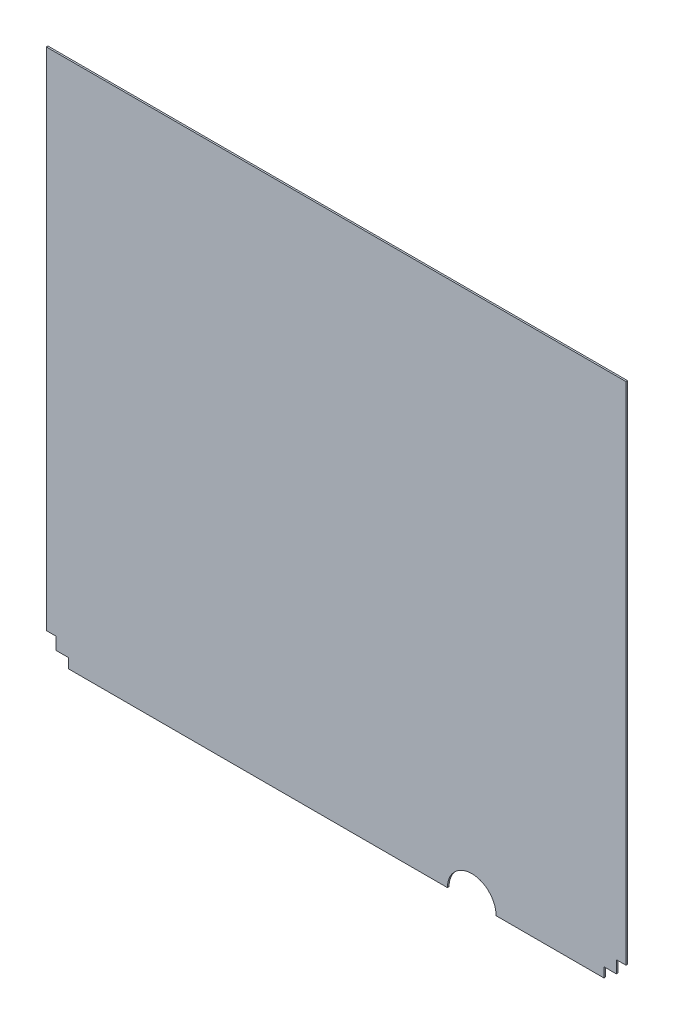
ISO-10303-21;
HEADER;
FILE_DESCRIPTION(('STEP AP214'),'2;1');
FILE_NAME('part.step','',(''),(''),'','','');
FILE_SCHEMA(('AUTOMOTIVE_DESIGN { 1 0 10303 214 1 1 1 1 }'));
ENDSEC;
DATA;
#1=APPLICATION_CONTEXT('core data for automotive mechanical design processes');
#2=APPLICATION_PROTOCOL_DEFINITION('international standard','automotive_design',2000,#1);
#3=PRODUCT_CONTEXT('',#1,'mechanical');
#4=PRODUCT('Part','Part','',(#3));
#5=PRODUCT_RELATED_PRODUCT_CATEGORY('part','',(#4));
#6=PRODUCT_DEFINITION_FORMATION('','',#4);
#7=PRODUCT_DEFINITION_CONTEXT('part definition',#1,'design');
#8=PRODUCT_DEFINITION('design','',#6,#7);
#9=PRODUCT_DEFINITION_SHAPE('','',#8);
#10=(LENGTH_UNIT() NAMED_UNIT(*) SI_UNIT(.MILLI.,.METRE.));
#11=(NAMED_UNIT(*) PLANE_ANGLE_UNIT() SI_UNIT($,.RADIAN.));
#12=(NAMED_UNIT(*) SI_UNIT($,.STERADIAN.) SOLID_ANGLE_UNIT());
#13=UNCERTAINTY_MEASURE_WITH_UNIT(LENGTH_MEASURE(1.E-05),#10,'distance_accuracy_value','');
#14=(GEOMETRIC_REPRESENTATION_CONTEXT(3) GLOBAL_UNCERTAINTY_ASSIGNED_CONTEXT((#13)) GLOBAL_UNIT_ASSIGNED_CONTEXT((#10,
#11,#12)) REPRESENTATION_CONTEXT('',''));
#15=CARTESIAN_POINT('',(0.,0.,0.));
#16=DIRECTION('',(0.,0.,1.));
#17=DIRECTION('',(1.,0.,0.));
#18=AXIS2_PLACEMENT_3D('',#15,#16,#17);
#19=CARTESIAN_POINT('',(665.70098,0.,2.54));
#20=DIRECTION('',(0.,0.,-1.));
#21=DIRECTION('',(-1.,0.,0.));
#22=AXIS2_PLACEMENT_3D('',#19,#20,#21);
#23=CYLINDRICAL_SURFACE('',#22,38.1);
#24=CARTESIAN_POINT('',(665.70098,0.,0.));
#25=DIRECTION('',(0.,0.,1.));
#26=DIRECTION('',(1.,0.,0.));
#27=AXIS2_PLACEMENT_3D('',#24,#25,#26);
#28=CIRCLE('',#27,38.1);
#29=CARTESIAN_POINT('',(703.80098,0.,0.));
#30=VERTEX_POINT('',#29);
#31=CARTESIAN_POINT('',(627.60098,0.,0.));
#32=VERTEX_POINT('',#31);
#33=EDGE_CURVE('E182',#30,#32,#28,.T.);
#34=ORIENTED_EDGE('',*,*,#33,.F.);
#35=DIRECTION('',(0.,0.,-1.));
#36=VECTOR('',#35,1.);
#37=CARTESIAN_POINT('',(703.80098,0.,2.54));
#38=LINE('',#37,#36);
#39=CARTESIAN_POINT('',(703.80098,0.,2.54));
#40=VERTEX_POINT('',#39);
#41=EDGE_CURVE('E11',#40,#30,#38,.T.);
#42=ORIENTED_EDGE('',*,*,#41,.F.);
#43=CARTESIAN_POINT('',(665.70098,0.,2.54));
#44=DIRECTION('',(0.,0.,1.));
#45=DIRECTION('',(1.,0.,0.));
#46=AXIS2_PLACEMENT_3D('',#43,#44,#45);
#47=CIRCLE('',#46,38.1);
#48=CARTESIAN_POINT('',(627.60098,0.,2.54));
#49=VERTEX_POINT('',#48);
#50=EDGE_CURVE('E287',#40,#49,#47,.T.);
#51=ORIENTED_EDGE('',*,*,#50,.T.);
#52=DIRECTION('',(0.,0.,-1.));
#53=VECTOR('',#52,1.);
#54=CARTESIAN_POINT('',(627.60098,0.,2.54));
#55=LINE('',#54,#53);
#56=EDGE_CURVE('E117',#49,#32,#55,.T.);
#57=ORIENTED_EDGE('',*,*,#56,.T.);
#58=EDGE_LOOP('',(#34,#42,#51,#57));
#59=FACE_BOUND('',#58,.T.);
#60=ADVANCED_FACE('F47',(#59),#23,.F.);
#61=CARTESIAN_POINT('',(0.,0.,2.54));
#62=DIRECTION('',(0.,1.,0.));
#63=DIRECTION('',(0.,0.,1.));
#64=AXIS2_PLACEMENT_3D('',#61,#62,#63);
#65=PLANE('',#64);
#66=DIRECTION('',(1.,0.,0.));
#67=VECTOR('',#66,1.);
#68=CARTESIAN_POINT('',(0.,0.,0.));
#69=LINE('',#68,#67);
#70=CARTESIAN_POINT('',(872.45698,0.,0.));
#71=VERTEX_POINT('',#70);
#72=EDGE_CURVE('E186',#30,#71,#69,.T.);
#73=ORIENTED_EDGE('',*,*,#72,.T.);
#74=DIRECTION('',(0.,0.,-1.));
#75=VECTOR('',#74,1.);
#76=CARTESIAN_POINT('',(872.45698,0.,2.54));
#77=LINE('',#76,#75);
#78=CARTESIAN_POINT('',(872.45698,0.,2.54));
#79=VERTEX_POINT('',#78);
#80=EDGE_CURVE('E56',#79,#71,#77,.T.);
#81=ORIENTED_EDGE('',*,*,#80,.F.);
#82=DIRECTION('',(1.,0.,0.));
#83=VECTOR('',#82,1.);
#84=CARTESIAN_POINT('',(0.,0.,2.54));
#85=LINE('',#84,#83);
#86=EDGE_CURVE('E179',#40,#79,#85,.T.);
#87=ORIENTED_EDGE('',*,*,#86,.F.);
#88=ORIENTED_EDGE('',*,*,#41,.T.);
#89=EDGE_LOOP('',(#73,#81,#87,#88));
#90=FACE_BOUND('',#89,.T.);
#91=ADVANCED_FACE('F269',(#90),#65,.F.);
#92=CARTESIAN_POINT('',(872.45698,0.,2.54));
#93=DIRECTION('',(1.,0.,0.));
#94=DIRECTION('',(0.,0.,-1.));
#95=AXIS2_PLACEMENT_3D('',#92,#93,#94);
#96=PLANE('',#95);
#97=DIRECTION('',(0.,-1.,0.));
#98=VECTOR('',#97,1.);
#99=CARTESIAN_POINT('',(872.45698,0.,0.));
#100=LINE('',#99,#98);
#101=CARTESIAN_POINT('',(872.45698,15.24,0.));
#102=VERTEX_POINT('',#101);
#103=EDGE_CURVE('E190',#102,#71,#100,.T.);
#104=ORIENTED_EDGE('',*,*,#103,.F.);
#105=DIRECTION('',(0.,0.,-1.));
#106=VECTOR('',#105,1.);
#107=CARTESIAN_POINT('',(872.45698,15.24,2.54));
#108=LINE('',#107,#106);
#109=CARTESIAN_POINT('',(872.45698,15.24,2.54));
#110=VERTEX_POINT('',#109);
#111=EDGE_CURVE('E257',#110,#102,#108,.T.);
#112=ORIENTED_EDGE('',*,*,#111,.F.);
#113=DIRECTION('',(0.,-1.,0.));
#114=VECTOR('',#113,1.);
#115=CARTESIAN_POINT('',(872.45698,0.,2.54));
#116=LINE('',#115,#114);
#117=EDGE_CURVE('E266',#110,#79,#116,.T.);
#118=ORIENTED_EDGE('',*,*,#117,.T.);
#119=ORIENTED_EDGE('',*,*,#80,.T.);
#120=EDGE_LOOP('',(#104,#112,#118,#119));
#121=FACE_BOUND('',#120,.T.);
#122=ADVANCED_FACE('F264',(#121),#96,.T.);
#123=CARTESIAN_POINT('',(0.,15.2399999999999,2.54));
#124=DIRECTION('',(0.,-1.,0.));
#125=DIRECTION('',(1.,0.,0.));
#126=AXIS2_PLACEMENT_3D('',#123,#124,#125);
#127=PLANE('',#126);
#128=DIRECTION('',(-1.,0.,0.));
#129=VECTOR('',#128,1.);
#130=CARTESIAN_POINT('',(0.,15.2399999999999,0.));
#131=LINE('',#130,#129);
#132=CARTESIAN_POINT('',(891.76098,15.24,0.));
#133=VERTEX_POINT('',#132);
#134=EDGE_CURVE('E195',#133,#102,#131,.T.);
#135=ORIENTED_EDGE('',*,*,#134,.F.);
#136=DIRECTION('',(0.,0.,-1.));
#137=VECTOR('',#136,1.);
#138=CARTESIAN_POINT('',(891.76098,15.24,2.54));
#139=LINE('',#138,#137);
#140=CARTESIAN_POINT('',(891.76098,15.24,2.54));
#141=VERTEX_POINT('',#140);
#142=EDGE_CURVE('E254',#141,#133,#139,.T.);
#143=ORIENTED_EDGE('',*,*,#142,.F.);
#144=DIRECTION('',(-1.,0.,0.));
#145=VECTOR('',#144,1.);
#146=CARTESIAN_POINT('',(0.,15.2399999999999,2.54));
#147=LINE('',#146,#145);
#148=EDGE_CURVE('E278',#141,#110,#147,.T.);
#149=ORIENTED_EDGE('',*,*,#148,.T.);
#150=ORIENTED_EDGE('',*,*,#111,.T.);
#151=EDGE_LOOP('',(#135,#143,#149,#150));
#152=FACE_BOUND('',#151,.T.);
#153=ADVANCED_FACE('F275',(#152),#127,.T.);
#154=CARTESIAN_POINT('',(891.76098,0.,2.54));
#155=DIRECTION('',(1.,0.,0.));
#156=DIRECTION('',(0.,0.,-1.));
#157=AXIS2_PLACEMENT_3D('',#154,#155,#156);
#158=PLANE('',#157);
#159=DIRECTION('',(0.,-1.,0.));
#160=VECTOR('',#159,1.);
#161=CARTESIAN_POINT('',(891.76098,0.,0.));
#162=LINE('',#161,#160);
#163=CARTESIAN_POINT('',(891.76098,34.544,0.));
#164=VERTEX_POINT('',#163);
#165=EDGE_CURVE('E199',#164,#133,#162,.T.);
#166=ORIENTED_EDGE('',*,*,#165,.F.);
#167=DIRECTION('',(0.,0.,-1.));
#168=VECTOR('',#167,1.);
#169=CARTESIAN_POINT('',(891.76098,34.544,2.54));
#170=LINE('',#169,#168);
#171=CARTESIAN_POINT('',(891.76098,34.544,2.54));
#172=VERTEX_POINT('',#171);
#173=EDGE_CURVE('E251',#172,#164,#170,.T.);
#174=ORIENTED_EDGE('',*,*,#173,.F.);
#175=DIRECTION('',(0.,-1.,0.));
#176=VECTOR('',#175,1.);
#177=CARTESIAN_POINT('',(891.76098,0.,2.54));
#178=LINE('',#177,#176);
#179=EDGE_CURVE('E285',#172,#141,#178,.T.);
#180=ORIENTED_EDGE('',*,*,#179,.T.);
#181=ORIENTED_EDGE('',*,*,#142,.T.);
#182=EDGE_LOOP('',(#166,#174,#180,#181));
#183=FACE_BOUND('',#182,.T.);
#184=ADVANCED_FACE('F365',(#183),#158,.T.);
#185=CARTESIAN_POINT('',(0.,34.5439999999996,2.54));
#186=DIRECTION('',(0.,-1.,0.));
#187=DIRECTION('',(1.,0.,0.));
#188=AXIS2_PLACEMENT_3D('',#185,#186,#187);
#189=PLANE('',#188);
#190=DIRECTION('',(-1.,0.,0.));
#191=VECTOR('',#190,1.);
#192=CARTESIAN_POINT('',(0.,34.5439999999996,0.));
#193=LINE('',#192,#191);
#194=CARTESIAN_POINT('',(907.00098,34.544,0.));
#195=VERTEX_POINT('',#194);
#196=EDGE_CURVE('E203',#195,#164,#193,.T.);
#197=ORIENTED_EDGE('',*,*,#196,.F.);
#198=DIRECTION('',(0.,0.,-1.));
#199=VECTOR('',#198,1.);
#200=CARTESIAN_POINT('',(907.00098,34.544,2.54));
#201=LINE('',#200,#199);
#202=CARTESIAN_POINT('',(907.00098,34.544,2.54));
#203=VERTEX_POINT('',#202);
#204=EDGE_CURVE('E248',#203,#195,#201,.T.);
#205=ORIENTED_EDGE('',*,*,#204,.F.);
#206=DIRECTION('',(-1.,0.,0.));
#207=VECTOR('',#206,1.);
#208=CARTESIAN_POINT('',(0.,34.5439999999996,2.54));
#209=LINE('',#208,#207);
#210=EDGE_CURVE('E292',#203,#172,#209,.T.);
#211=ORIENTED_EDGE('',*,*,#210,.T.);
#212=ORIENTED_EDGE('',*,*,#173,.T.);
#213=EDGE_LOOP('',(#197,#205,#211,#212));
#214=FACE_BOUND('',#213,.T.);
#215=ADVANCED_FACE('F361',(#214),#189,.T.);
#216=CARTESIAN_POINT('',(907.00098,0.,2.54));
#217=DIRECTION('',(-1.,0.,0.));
#218=DIRECTION('',(0.,0.,1.));
#219=AXIS2_PLACEMENT_3D('',#216,#217,#218);
#220=PLANE('',#219);
#221=DIRECTION('',(0.,1.,0.));
#222=VECTOR('',#221,1.);
#223=CARTESIAN_POINT('',(907.00098,0.,0.));
#224=LINE('',#223,#222);
#225=CARTESIAN_POINT('',(907.00098,825.5,0.));
#226=VERTEX_POINT('',#225);
#227=EDGE_CURVE('E207',#195,#226,#224,.T.);
#228=ORIENTED_EDGE('',*,*,#227,.T.);
#229=DIRECTION('',(0.,0.,-1.));
#230=VECTOR('',#229,1.);
#231=CARTESIAN_POINT('',(907.00098,825.5,2.54));
#232=LINE('',#231,#230);
#233=CARTESIAN_POINT('',(907.00098,825.5,2.54));
#234=VERTEX_POINT('',#233);
#235=EDGE_CURVE('E245',#234,#226,#232,.T.);
#236=ORIENTED_EDGE('',*,*,#235,.F.);
#237=DIRECTION('',(0.,1.,0.));
#238=VECTOR('',#237,1.);
#239=CARTESIAN_POINT('',(907.00098,0.,2.54));
#240=LINE('',#239,#238);
#241=EDGE_CURVE('E296',#203,#234,#240,.T.);
#242=ORIENTED_EDGE('',*,*,#241,.F.);
#243=ORIENTED_EDGE('',*,*,#204,.T.);
#244=EDGE_LOOP('',(#228,#236,#242,#243));
#245=FACE_BOUND('',#244,.T.);
#246=ADVANCED_FACE('F357',(#245),#220,.F.);
#247=CARTESIAN_POINT('',(0.,825.5,2.54));
#248=DIRECTION('',(0.,1.,0.));
#249=DIRECTION('',(0.,0.,1.));
#250=AXIS2_PLACEMENT_3D('',#247,#248,#249);
#251=PLANE('',#250);
#252=DIRECTION('',(1.,0.,0.));
#253=VECTOR('',#252,1.);
#254=CARTESIAN_POINT('',(0.,825.5,0.));
#255=LINE('',#254,#253);
#256=CARTESIAN_POINT('',(0.,825.5,0.));
#257=VERTEX_POINT('',#256);
#258=EDGE_CURVE('E211',#257,#226,#255,.T.);
#259=ORIENTED_EDGE('',*,*,#258,.F.);
#260=DIRECTION('',(0.,0.,-1.));
#261=VECTOR('',#260,1.);
#262=CARTESIAN_POINT('',(0.,825.5,2.54));
#263=LINE('',#262,#261);
#264=CARTESIAN_POINT('',(0.,825.5,2.54));
#265=VERTEX_POINT('',#264);
#266=EDGE_CURVE('E242',#265,#257,#263,.T.);
#267=ORIENTED_EDGE('',*,*,#266,.F.);
#268=DIRECTION('',(1.,0.,0.));
#269=VECTOR('',#268,1.);
#270=CARTESIAN_POINT('',(0.,825.5,2.54));
#271=LINE('',#270,#269);
#272=EDGE_CURVE('E299',#265,#234,#271,.T.);
#273=ORIENTED_EDGE('',*,*,#272,.T.);
#274=ORIENTED_EDGE('',*,*,#235,.T.);
#275=EDGE_LOOP('',(#259,#267,#273,#274));
#276=FACE_BOUND('',#275,.T.);
#277=ADVANCED_FACE('F353',(#276),#251,.T.);
#278=CARTESIAN_POINT('',(0.,0.,2.54));
#279=DIRECTION('',(-1.,0.,0.));
#280=DIRECTION('',(0.,0.,1.));
#281=AXIS2_PLACEMENT_3D('',#278,#279,#280);
#282=PLANE('',#281);
#283=DIRECTION('',(0.,1.,0.));
#284=VECTOR('',#283,1.);
#285=CARTESIAN_POINT('',(0.,0.,0.));
#286=LINE('',#285,#284);
#287=CARTESIAN_POINT('',(0.,34.544,0.));
#288=VERTEX_POINT('',#287);
#289=EDGE_CURVE('E215',#288,#257,#286,.T.);
#290=ORIENTED_EDGE('',*,*,#289,.F.);
#291=DIRECTION('',(0.,0.,-1.));
#292=VECTOR('',#291,1.);
#293=CARTESIAN_POINT('',(0.,34.544,2.54));
#294=LINE('',#293,#292);
#295=CARTESIAN_POINT('',(0.,34.544,2.54));
#296=VERTEX_POINT('',#295);
#297=EDGE_CURVE('E239',#296,#288,#294,.T.);
#298=ORIENTED_EDGE('',*,*,#297,.F.);
#299=DIRECTION('',(0.,1.,0.));
#300=VECTOR('',#299,1.);
#301=CARTESIAN_POINT('',(0.,0.,2.54));
#302=LINE('',#301,#300);
#303=EDGE_CURVE('E303',#296,#265,#302,.T.);
#304=ORIENTED_EDGE('',*,*,#303,.T.);
#305=ORIENTED_EDGE('',*,*,#266,.T.);
#306=EDGE_LOOP('',(#290,#298,#304,#305));
#307=FACE_BOUND('',#306,.T.);
#308=ADVANCED_FACE('F350',(#307),#282,.T.);
#309=CARTESIAN_POINT('',(0.,34.544,2.54));
#310=DIRECTION('',(0.,1.,0.));
#311=DIRECTION('',(0.,0.,1.));
#312=AXIS2_PLACEMENT_3D('',#309,#310,#311);
#313=PLANE('',#312);
#314=DIRECTION('',(1.,0.,0.));
#315=VECTOR('',#314,1.);
#316=CARTESIAN_POINT('',(0.,34.544,0.));
#317=LINE('',#316,#315);
#318=CARTESIAN_POINT('',(15.24,34.544,0.));
#319=VERTEX_POINT('',#318);
#320=EDGE_CURVE('E219',#288,#319,#317,.T.);
#321=ORIENTED_EDGE('',*,*,#320,.T.);
#322=DIRECTION('',(0.,0.,-1.));
#323=VECTOR('',#322,1.);
#324=CARTESIAN_POINT('',(15.24,34.544,2.54));
#325=LINE('',#324,#323);
#326=CARTESIAN_POINT('',(15.24,34.544,2.54));
#327=VERTEX_POINT('',#326);
#328=EDGE_CURVE('E235',#327,#319,#325,.T.);
#329=ORIENTED_EDGE('',*,*,#328,.F.);
#330=DIRECTION('',(1.,0.,0.));
#331=VECTOR('',#330,1.);
#332=CARTESIAN_POINT('',(0.,34.544,2.54));
#333=LINE('',#332,#331);
#334=EDGE_CURVE('E307',#296,#327,#333,.T.);
#335=ORIENTED_EDGE('',*,*,#334,.F.);
#336=ORIENTED_EDGE('',*,*,#297,.T.);
#337=EDGE_LOOP('',(#321,#329,#335,#336));
#338=FACE_BOUND('',#337,.T.);
#339=ADVANCED_FACE('F315',(#338),#313,.F.);
#340=CARTESIAN_POINT('',(15.24,0.,2.54));
#341=DIRECTION('',(1.,0.,0.));
#342=DIRECTION('',(0.,1.,0.));
#343=AXIS2_PLACEMENT_3D('',#340,#341,#342);
#344=PLANE('',#343);
#345=DIRECTION('',(0.,-1.,0.));
#346=VECTOR('',#345,1.);
#347=CARTESIAN_POINT('',(15.24,0.,0.));
#348=LINE('',#347,#346);
#349=CARTESIAN_POINT('',(15.24,15.24,0.));
#350=VERTEX_POINT('',#349);
#351=EDGE_CURVE('E222',#319,#350,#348,.T.);
#352=ORIENTED_EDGE('',*,*,#351,.T.);
#353=DIRECTION('',(0.,0.,-1.));
#354=VECTOR('',#353,1.);
#355=CARTESIAN_POINT('',(15.24,15.24,2.54));
#356=LINE('',#355,#354);
#357=CARTESIAN_POINT('',(15.24,15.24,2.54));
#358=VERTEX_POINT('',#357);
#359=EDGE_CURVE('E171',#358,#350,#356,.T.);
#360=ORIENTED_EDGE('',*,*,#359,.F.);
#361=DIRECTION('',(0.,-1.,0.));
#362=VECTOR('',#361,1.);
#363=CARTESIAN_POINT('',(15.24,0.,2.54));
#364=LINE('',#363,#362);
#365=EDGE_CURVE('E160',#327,#358,#364,.T.);
#366=ORIENTED_EDGE('',*,*,#365,.F.);
#367=ORIENTED_EDGE('',*,*,#328,.T.);
#368=EDGE_LOOP('',(#352,#360,#366,#367));
#369=FACE_BOUND('',#368,.T.);
#370=ADVANCED_FACE('F319',(#369),#344,.F.);
#371=CARTESIAN_POINT('',(0.,15.24,2.54));
#372=DIRECTION('',(0.,1.,0.));
#373=DIRECTION('',(0.,0.,1.));
#374=AXIS2_PLACEMENT_3D('',#371,#372,#373);
#375=PLANE('',#374);
#376=DIRECTION('',(1.,0.,0.));
#377=VECTOR('',#376,1.);
#378=CARTESIAN_POINT('',(0.,15.24,0.));
#379=LINE('',#378,#377);
#380=CARTESIAN_POINT('',(34.544,15.24,0.));
#381=VERTEX_POINT('',#380);
#382=EDGE_CURVE('E169',#350,#381,#379,.T.);
#383=ORIENTED_EDGE('',*,*,#382,.T.);
#384=DIRECTION('',(0.,0.,-1.));
#385=VECTOR('',#384,1.);
#386=CARTESIAN_POINT('',(34.544,15.24,2.54));
#387=LINE('',#386,#385);
#388=CARTESIAN_POINT('',(34.544,15.24,2.54));
#389=VERTEX_POINT('',#388);
#390=EDGE_CURVE('E166',#389,#381,#387,.T.);
#391=ORIENTED_EDGE('',*,*,#390,.F.);
#392=DIRECTION('',(1.,0.,0.));
#393=VECTOR('',#392,1.);
#394=CARTESIAN_POINT('',(0.,15.24,2.54));
#395=LINE('',#394,#393);
#396=EDGE_CURVE('E154',#358,#389,#395,.T.);
#397=ORIENTED_EDGE('',*,*,#396,.F.);
#398=ORIENTED_EDGE('',*,*,#359,.T.);
#399=EDGE_LOOP('',(#383,#391,#397,#398));
#400=FACE_BOUND('',#399,.T.);
#401=ADVANCED_FACE('F167',(#400),#375,.F.);
#402=CARTESIAN_POINT('',(34.544,0.,2.54));
#403=DIRECTION('',(1.,0.,0.));
#404=DIRECTION('',(0.,0.,-1.));
#405=AXIS2_PLACEMENT_3D('',#402,#403,#404);
#406=PLANE('',#405);
#407=DIRECTION('',(0.,-1.,0.));
#408=VECTOR('',#407,1.);
#409=CARTESIAN_POINT('',(34.544,0.,0.));
#410=LINE('',#409,#408);
#411=CARTESIAN_POINT('',(34.544,0.,0.));
#412=VERTEX_POINT('',#411);
#413=EDGE_CURVE('E110',#381,#412,#410,.T.);
#414=ORIENTED_EDGE('',*,*,#413,.T.);
#415=DIRECTION('',(0.,0.,-1.));
#416=VECTOR('',#415,1.);
#417=CARTESIAN_POINT('',(34.544,0.,2.54));
#418=LINE('',#417,#416);
#419=CARTESIAN_POINT('',(34.544,0.,2.54));
#420=VERTEX_POINT('',#419);
#421=EDGE_CURVE('E172',#420,#412,#418,.T.);
#422=ORIENTED_EDGE('',*,*,#421,.F.);
#423=DIRECTION('',(0.,-1.,0.));
#424=VECTOR('',#423,1.);
#425=CARTESIAN_POINT('',(34.544,0.,2.54));
#426=LINE('',#425,#424);
#427=EDGE_CURVE('E158',#389,#420,#426,.T.);
#428=ORIENTED_EDGE('',*,*,#427,.F.);
#429=ORIENTED_EDGE('',*,*,#390,.T.);
#430=EDGE_LOOP('',(#414,#422,#428,#429));
#431=FACE_BOUND('',#430,.T.);
#432=ADVANCED_FACE('F174',(#431),#406,.F.);
#433=EDGE_CURVE('E191',#412,#32,#69,.T.);
#434=ORIENTED_EDGE('',*,*,#433,.T.);
#435=ORIENTED_EDGE('',*,*,#56,.F.);
#436=EDGE_CURVE('E64',#420,#49,#85,.T.);
#437=ORIENTED_EDGE('',*,*,#436,.F.);
#438=ORIENTED_EDGE('',*,*,#421,.T.);
#439=EDGE_LOOP('',(#434,#435,#437,#438));
#440=FACE_BOUND('',#439,.T.);
#441=ADVANCED_FACE('F329',(#440),#65,.F.);
#442=CARTESIAN_POINT('',(0.,0.,2.54));
#443=DIRECTION('',(0.,0.,1.));
#444=DIRECTION('',(1.,0.,0.));
#445=AXIS2_PLACEMENT_3D('',#442,#443,#444);
#446=PLANE('',#445);
#447=ORIENTED_EDGE('',*,*,#50,.F.);
#448=ORIENTED_EDGE('',*,*,#86,.T.);
#449=ORIENTED_EDGE('',*,*,#117,.F.);
#450=ORIENTED_EDGE('',*,*,#148,.F.);
#451=ORIENTED_EDGE('',*,*,#179,.F.);
#452=ORIENTED_EDGE('',*,*,#210,.F.);
#453=ORIENTED_EDGE('',*,*,#241,.T.);
#454=ORIENTED_EDGE('',*,*,#272,.F.);
#455=ORIENTED_EDGE('',*,*,#303,.F.);
#456=ORIENTED_EDGE('',*,*,#334,.T.);
#457=ORIENTED_EDGE('',*,*,#365,.T.);
#458=ORIENTED_EDGE('',*,*,#396,.T.);
#459=ORIENTED_EDGE('',*,*,#427,.T.);
#460=ORIENTED_EDGE('',*,*,#436,.T.);
#461=EDGE_LOOP('',(#447,#448,#449,#450,#451,#452,#453,#454,#455,#456,#457,#458,#459,#460));
#462=FACE_BOUND('',#461,.T.);
#463=ADVANCED_FACE('F156',(#462),#446,.T.);
#464=CARTESIAN_POINT('',(0.,0.,0.));
#465=DIRECTION('',(0.,0.,1.));
#466=DIRECTION('',(1.,0.,0.));
#467=AXIS2_PLACEMENT_3D('',#464,#465,#466);
#468=PLANE('',#467);
#469=ORIENTED_EDGE('',*,*,#33,.T.);
#470=ORIENTED_EDGE('',*,*,#433,.F.);
#471=ORIENTED_EDGE('',*,*,#413,.F.);
#472=ORIENTED_EDGE('',*,*,#382,.F.);
#473=ORIENTED_EDGE('',*,*,#351,.F.);
#474=ORIENTED_EDGE('',*,*,#320,.F.);
#475=ORIENTED_EDGE('',*,*,#289,.T.);
#476=ORIENTED_EDGE('',*,*,#258,.T.);
#477=ORIENTED_EDGE('',*,*,#227,.F.);
#478=ORIENTED_EDGE('',*,*,#196,.T.);
#479=ORIENTED_EDGE('',*,*,#165,.T.);
#480=ORIENTED_EDGE('',*,*,#134,.T.);
#481=ORIENTED_EDGE('',*,*,#103,.T.);
#482=ORIENTED_EDGE('',*,*,#72,.F.);
#483=EDGE_LOOP('',(#469,#470,#471,#472,#473,#474,#475,#476,#477,#478,#479,#480,#481,#482));
#484=FACE_BOUND('',#483,.T.);
#485=ADVANCED_FACE('F271',(#484),#468,.F.);
#486=CLOSED_SHELL('',(#60,#91,#122,#153,#184,#215,#246,#277,#308,#339,#370,#401,#432,#441,#463,#485));
#487=MANIFOLD_SOLID_BREP('B2',#486);
#488=ADVANCED_BREP_SHAPE_REPRESENTATION('',(#18,#487),#14);
#489=SHAPE_DEFINITION_REPRESENTATION(#9,#488);
ENDSEC;
END-ISO-10303-21;
